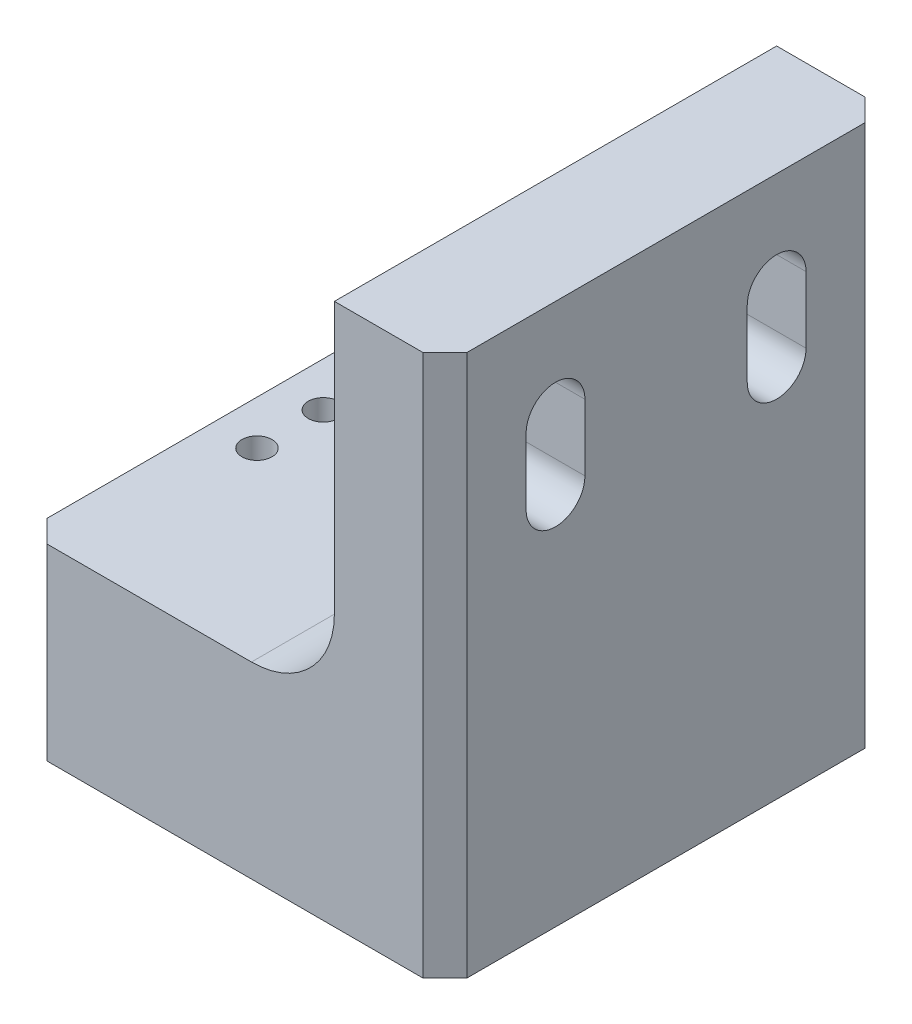
ISO-10303-21;
HEADER;
FILE_DESCRIPTION(('STEP AP214'),'2;1');
FILE_NAME('part.step','',(''),(''),'','','');
FILE_SCHEMA(('AUTOMOTIVE_DESIGN { 1 0 10303 214 1 1 1 1 }'));
ENDSEC;
DATA;
#1=APPLICATION_CONTEXT('core data for automotive mechanical design processes');
#2=APPLICATION_PROTOCOL_DEFINITION('international standard','automotive_design',2000,#1);
#3=PRODUCT_CONTEXT('',#1,'mechanical');
#4=PRODUCT('Part','Part','',(#3));
#5=PRODUCT_RELATED_PRODUCT_CATEGORY('part','',(#4));
#6=PRODUCT_DEFINITION_FORMATION('','',#4);
#7=PRODUCT_DEFINITION_CONTEXT('part definition',#1,'design');
#8=PRODUCT_DEFINITION('design','',#6,#7);
#9=PRODUCT_DEFINITION_SHAPE('','',#8);
#10=(LENGTH_UNIT() NAMED_UNIT(*) SI_UNIT(.MILLI.,.METRE.));
#11=(NAMED_UNIT(*) PLANE_ANGLE_UNIT() SI_UNIT($,.RADIAN.));
#12=(NAMED_UNIT(*) SI_UNIT($,.STERADIAN.) SOLID_ANGLE_UNIT());
#13=UNCERTAINTY_MEASURE_WITH_UNIT(LENGTH_MEASURE(1.E-05),#10,'distance_accuracy_value','');
#14=(GEOMETRIC_REPRESENTATION_CONTEXT(3) GLOBAL_UNCERTAINTY_ASSIGNED_CONTEXT((#13)) GLOBAL_UNIT_ASSIGNED_CONTEXT((#10,
#11,#12)) REPRESENTATION_CONTEXT('',''));
#15=CARTESIAN_POINT('',(0.,0.,0.));
#16=DIRECTION('',(0.,0.,1.));
#17=DIRECTION('',(1.,0.,0.));
#18=AXIS2_PLACEMENT_3D('',#15,#16,#17);
#19=CARTESIAN_POINT('',(0.,21.59,-25.4));
#20=DIRECTION('',(-1.,0.,0.));
#21=DIRECTION('',(0.,0.,1.));
#22=AXIS2_PLACEMENT_3D('',#19,#20,#21);
#23=PLANE('',#22);
#24=DIRECTION('',(0.,0.,1.));
#25=VECTOR('',#24,1.);
#26=CARTESIAN_POINT('',(0.,21.59,-25.4));
#27=LINE('',#26,#25);
#28=CARTESIAN_POINT('',(0.,21.59,-22.86));
#29=VERTEX_POINT('',#28);
#30=CARTESIAN_POINT('',(0.,21.59,22.86));
#31=VERTEX_POINT('',#30);
#32=EDGE_CURVE('E268',#29,#31,#27,.T.);
#33=ORIENTED_EDGE('',*,*,#32,.F.);
#34=DIRECTION('',(0.,-1.,0.));
#35=VECTOR('',#34,1.);
#36=CARTESIAN_POINT('',(0.,0.,-22.86));
#37=LINE('',#36,#35);
#38=CARTESIAN_POINT('',(0.,0.,-22.86));
#39=VERTEX_POINT('',#38);
#40=EDGE_CURVE('E292',#29,#39,#37,.T.);
#41=ORIENTED_EDGE('',*,*,#40,.T.);
#42=DIRECTION('',(0.,0.,1.));
#43=VECTOR('',#42,1.);
#44=CARTESIAN_POINT('',(0.,0.,-25.4));
#45=LINE('',#44,#43);
#46=CARTESIAN_POINT('',(0.,0.,22.86));
#47=VERTEX_POINT('',#46);
#48=EDGE_CURVE('E267',#39,#47,#45,.T.);
#49=ORIENTED_EDGE('',*,*,#48,.T.);
#50=DIRECTION('',(0.,1.,0.));
#51=VECTOR('',#50,1.);
#52=CARTESIAN_POINT('',(0.,21.59,22.86));
#53=LINE('',#52,#51);
#54=EDGE_CURVE('E290',#47,#31,#53,.T.);
#55=ORIENTED_EDGE('',*,*,#54,.T.);
#56=EDGE_LOOP('',(#33,#41,#49,#55));
#57=FACE_BOUND('',#56,.T.);
#58=ADVANCED_FACE('F32',(#57),#23,.T.);
#59=CARTESIAN_POINT('',(35.56,21.59,-25.4));
#60=DIRECTION('',(0.,1.,0.));
#61=DIRECTION('',(-1.,0.,0.));
#62=AXIS2_PLACEMENT_3D('',#59,#60,#61);
#63=PLANE('',#62);
#64=CARTESIAN_POINT('',(5.08,21.59,-3.81));
#65=DIRECTION('',(0.,1.,0.));
#66=DIRECTION('',(0.,0.,1.));
#67=AXIS2_PLACEMENT_3D('',#64,#65,#66);
#68=CIRCLE('',#67,1.7272);
#69=CARTESIAN_POINT('',(5.08,21.59,-2.0828));
#70=VERTEX_POINT('',#69);
#71=EDGE_CURVE('E233',#70,#70,#68,.T.);
#72=ORIENTED_EDGE('',*,*,#71,.F.);
#73=EDGE_LOOP('',(#72));
#74=FACE_BOUND('',#73,.T.);
#75=CARTESIAN_POINT('',(5.08,21.59,3.81));
#76=DIRECTION('',(0.,1.,0.));
#77=DIRECTION('',(0.,0.,1.));
#78=AXIS2_PLACEMENT_3D('',#75,#76,#77);
#79=CIRCLE('',#78,1.7272);
#80=CARTESIAN_POINT('',(5.08,21.59,5.5372));
#81=VERTEX_POINT('',#80);
#82=EDGE_CURVE('E239',#81,#81,#79,.T.);
#83=ORIENTED_EDGE('',*,*,#82,.F.);
#84=EDGE_LOOP('',(#83));
#85=FACE_BOUND('',#84,.T.);
#86=DIRECTION('',(-1.,0.,0.));
#87=VECTOR('',#86,1.);
#88=CARTESIAN_POINT('',(35.56,21.59,-25.4));
#89=LINE('',#88,#87);
#90=CARTESIAN_POINT('',(26.035,21.59,-25.4));
#91=VERTEX_POINT('',#90);
#92=CARTESIAN_POINT('',(2.54,21.59,-25.4));
#93=VERTEX_POINT('',#92);
#94=EDGE_CURVE('E264',#91,#93,#89,.T.);
#95=ORIENTED_EDGE('',*,*,#94,.T.);
#96=DIRECTION('',(-0.707106781186548,0.,0.707106781186548));
#97=VECTOR('',#96,1.);
#98=CARTESIAN_POINT('',(19.05,21.59,-41.91));
#99=LINE('',#98,#97);
#100=EDGE_CURVE('E309',#93,#29,#99,.T.);
#101=ORIENTED_EDGE('',*,*,#100,.T.);
#102=ORIENTED_EDGE('',*,*,#32,.T.);
#103=DIRECTION('',(-0.707106781186548,0.,-0.707106781186548));
#104=VECTOR('',#103,1.);
#105=CARTESIAN_POINT('',(-6.34999999999999,21.59,16.51));
#106=LINE('',#105,#104);
#107=CARTESIAN_POINT('',(2.54000000000002,21.59,25.4));
#108=VERTEX_POINT('',#107);
#109=EDGE_CURVE('E307',#31,#108,#106,.F.);
#110=ORIENTED_EDGE('',*,*,#109,.T.);
#111=DIRECTION('',(-1.,0.,0.));
#112=VECTOR('',#111,1.);
#113=CARTESIAN_POINT('',(35.56,21.59,25.4));
#114=LINE('',#113,#112);
#115=CARTESIAN_POINT('',(26.035,21.59,25.4));
#116=VERTEX_POINT('',#115);
#117=EDGE_CURVE('E253',#116,#108,#114,.T.);
#118=ORIENTED_EDGE('',*,*,#117,.F.);
#119=DIRECTION('',(0.,0.,1.));
#120=VECTOR('',#119,1.);
#121=CARTESIAN_POINT('',(26.035,21.59,-25.4));
#122=LINE('',#121,#120);
#123=EDGE_CURVE('E284',#116,#91,#122,.F.);
#124=ORIENTED_EDGE('',*,*,#123,.T.);
#125=EDGE_LOOP('',(#95,#101,#102,#110,#118,#124));
#126=FACE_BOUND('',#125,.T.);
#127=ADVANCED_FACE('F344',(#74,#85,#126),#63,.T.);
#128=CARTESIAN_POINT('',(35.56,62.23,-25.4));
#129=DIRECTION('',(-1.,0.,0.));
#130=DIRECTION('',(0.,0.,1.));
#131=AXIS2_PLACEMENT_3D('',#128,#129,#130);
#132=PLANE('',#131);
#133=CARTESIAN_POINT('',(35.56,50.8,12.7));
#134=DIRECTION('',(-1.,0.,0.));
#135=DIRECTION('',(0.,0.,1.));
#136=AXIS2_PLACEMENT_3D('',#133,#134,#135);
#137=CIRCLE('',#136,3.3782);
#138=CARTESIAN_POINT('',(35.56,50.8,16.0782));
#139=VERTEX_POINT('',#138);
#140=CARTESIAN_POINT('',(35.56,50.8,9.3218));
#141=VERTEX_POINT('',#140);
#142=EDGE_CURVE('E202',#139,#141,#137,.T.);
#143=ORIENTED_EDGE('',*,*,#142,.F.);
#144=DIRECTION('',(0.,1.,0.));
#145=VECTOR('',#144,1.);
#146=CARTESIAN_POINT('',(35.56,62.23,16.0782));
#147=LINE('',#146,#145);
#148=CARTESIAN_POINT('',(35.56,43.18,16.0782));
#149=VERTEX_POINT('',#148);
#150=EDGE_CURVE('E195',#149,#139,#147,.T.);
#151=ORIENTED_EDGE('',*,*,#150,.F.);
#152=CARTESIAN_POINT('',(35.56,43.18,12.7));
#153=DIRECTION('',(-1.,0.,0.));
#154=DIRECTION('',(0.,0.,1.));
#155=AXIS2_PLACEMENT_3D('',#152,#153,#154);
#156=CIRCLE('',#155,3.3782);
#157=CARTESIAN_POINT('',(35.56,43.18,9.3218));
#158=VERTEX_POINT('',#157);
#159=EDGE_CURVE('E170',#158,#149,#156,.T.);
#160=ORIENTED_EDGE('',*,*,#159,.F.);
#161=DIRECTION('',(0.,-1.,0.));
#162=VECTOR('',#161,1.);
#163=CARTESIAN_POINT('',(35.56,62.23,9.3218));
#164=LINE('',#163,#162);
#165=EDGE_CURVE('E200',#141,#158,#164,.T.);
#166=ORIENTED_EDGE('',*,*,#165,.F.);
#167=EDGE_LOOP('',(#143,#151,#160,#166));
#168=FACE_BOUND('',#167,.T.);
#169=CARTESIAN_POINT('',(35.56,50.8,-12.7));
#170=DIRECTION('',(-1.,0.,0.));
#171=DIRECTION('',(0.,0.,1.));
#172=AXIS2_PLACEMENT_3D('',#169,#170,#171);
#173=CIRCLE('',#172,3.3782);
#174=CARTESIAN_POINT('',(35.56,50.8,-9.32179999999999));
#175=VERTEX_POINT('',#174);
#176=CARTESIAN_POINT('',(35.56,50.8,-16.0782));
#177=VERTEX_POINT('',#176);
#178=EDGE_CURVE('E231',#175,#177,#173,.T.);
#179=ORIENTED_EDGE('',*,*,#178,.F.);
#180=DIRECTION('',(0.,1.,0.));
#181=VECTOR('',#180,1.);
#182=CARTESIAN_POINT('',(35.56,62.23,-9.32179999999999));
#183=LINE('',#182,#181);
#184=CARTESIAN_POINT('',(35.56,43.18,-9.32179999999999));
#185=VERTEX_POINT('',#184);
#186=EDGE_CURVE('E218',#185,#175,#183,.T.);
#187=ORIENTED_EDGE('',*,*,#186,.F.);
#188=CARTESIAN_POINT('',(35.56,43.18,-12.7));
#189=DIRECTION('',(-1.,0.,0.));
#190=DIRECTION('',(0.,0.,1.));
#191=AXIS2_PLACEMENT_3D('',#188,#189,#190);
#192=CIRCLE('',#191,3.3782);
#193=CARTESIAN_POINT('',(35.56,43.18,-16.0782));
#194=VERTEX_POINT('',#193);
#195=EDGE_CURVE('E226',#194,#185,#192,.T.);
#196=ORIENTED_EDGE('',*,*,#195,.F.);
#197=DIRECTION('',(0.,-1.,0.));
#198=VECTOR('',#197,1.);
#199=CARTESIAN_POINT('',(35.56,62.23,-16.0782));
#200=LINE('',#199,#198);
#201=EDGE_CURVE('E229',#177,#194,#200,.T.);
#202=ORIENTED_EDGE('',*,*,#201,.F.);
#203=EDGE_LOOP('',(#179,#187,#196,#202));
#204=FACE_BOUND('',#203,.T.);
#205=DIRECTION('',(0.,-1.,0.));
#206=VECTOR('',#205,1.);
#207=CARTESIAN_POINT('',(35.56,62.23,-25.4));
#208=LINE('',#207,#206);
#209=CARTESIAN_POINT('',(35.56,62.23,-25.4));
#210=VERTEX_POINT('',#209);
#211=CARTESIAN_POINT('',(35.56,31.115,-25.4));
#212=VERTEX_POINT('',#211);
#213=EDGE_CURVE('E261',#210,#212,#208,.T.);
#214=ORIENTED_EDGE('',*,*,#213,.T.);
#215=DIRECTION('',(0.,0.,1.));
#216=VECTOR('',#215,1.);
#217=CARTESIAN_POINT('',(35.56,31.115,25.4));
#218=LINE('',#217,#216);
#219=CARTESIAN_POINT('',(35.56,31.115,25.4));
#220=VERTEX_POINT('',#219);
#221=EDGE_CURVE('E271',#212,#220,#218,.T.);
#222=ORIENTED_EDGE('',*,*,#221,.T.);
#223=DIRECTION('',(0.,-1.,0.));
#224=VECTOR('',#223,1.);
#225=CARTESIAN_POINT('',(35.56,62.23,25.4));
#226=LINE('',#225,#224);
#227=CARTESIAN_POINT('',(35.56,62.23,25.4));
#228=VERTEX_POINT('',#227);
#229=EDGE_CURVE('E250',#228,#220,#226,.T.);
#230=ORIENTED_EDGE('',*,*,#229,.F.);
#231=DIRECTION('',(0.,0.,1.));
#232=VECTOR('',#231,1.);
#233=CARTESIAN_POINT('',(35.56,62.23,-25.4));
#234=LINE('',#233,#232);
#235=EDGE_CURVE('E272',#210,#228,#234,.T.);
#236=ORIENTED_EDGE('',*,*,#235,.F.);
#237=EDGE_LOOP('',(#214,#222,#230,#236));
#238=FACE_BOUND('',#237,.T.);
#239=ADVANCED_FACE('F362',(#168,#204,#238),#132,.T.);
#240=CARTESIAN_POINT('',(48.26,62.23,-25.4));
#241=DIRECTION('',(0.,1.,0.));
#242=DIRECTION('',(0.,0.,1.));
#243=AXIS2_PLACEMENT_3D('',#240,#241,#242);
#244=PLANE('',#243);
#245=DIRECTION('',(0.,0.,1.));
#246=VECTOR('',#245,1.);
#247=CARTESIAN_POINT('',(48.26,62.23,-25.4));
#248=LINE('',#247,#246);
#249=CARTESIAN_POINT('',(48.26,62.23,-22.86));
#250=VERTEX_POINT('',#249);
#251=CARTESIAN_POINT('',(48.26,62.23,22.86));
#252=VERTEX_POINT('',#251);
#253=EDGE_CURVE('E275',#250,#252,#248,.T.);
#254=ORIENTED_EDGE('',*,*,#253,.F.);
#255=DIRECTION('',(-0.707106781186548,0.,-0.707106781186548));
#256=VECTOR('',#255,1.);
#257=CARTESIAN_POINT('',(46.99,62.23,-24.13));
#258=LINE('',#257,#256);
#259=CARTESIAN_POINT('',(45.72,62.23,-25.4));
#260=VERTEX_POINT('',#259);
#261=EDGE_CURVE('E11',#250,#260,#258,.T.);
#262=ORIENTED_EDGE('',*,*,#261,.T.);
#263=DIRECTION('',(-1.,0.,0.));
#264=VECTOR('',#263,1.);
#265=CARTESIAN_POINT('',(48.26,62.23,-25.4));
#266=LINE('',#265,#264);
#267=EDGE_CURVE('E259',#260,#210,#266,.T.);
#268=ORIENTED_EDGE('',*,*,#267,.T.);
#269=ORIENTED_EDGE('',*,*,#235,.T.);
#270=DIRECTION('',(-1.,0.,0.));
#271=VECTOR('',#270,1.);
#272=CARTESIAN_POINT('',(48.26,62.23,25.4));
#273=LINE('',#272,#271);
#274=CARTESIAN_POINT('',(45.72,62.23,25.4));
#275=VERTEX_POINT('',#274);
#276=EDGE_CURVE('E248',#275,#228,#273,.T.);
#277=ORIENTED_EDGE('',*,*,#276,.F.);
#278=DIRECTION('',(-0.707106781186548,0.,0.707106781186548));
#279=VECTOR('',#278,1.);
#280=CARTESIAN_POINT('',(72.39,62.23,-1.27));
#281=LINE('',#280,#279);
#282=EDGE_CURVE('E40',#275,#252,#281,.F.);
#283=ORIENTED_EDGE('',*,*,#282,.T.);
#284=EDGE_LOOP('',(#254,#262,#268,#269,#277,#283));
#285=FACE_BOUND('',#284,.T.);
#286=ADVANCED_FACE('F324',(#285),#244,.T.);
#287=CARTESIAN_POINT('',(48.26,0.,-25.4));
#288=DIRECTION('',(1.,0.,0.));
#289=DIRECTION('',(0.,0.,-1.));
#290=AXIS2_PLACEMENT_3D('',#287,#288,#289);
#291=PLANE('',#290);
#292=CARTESIAN_POINT('',(48.26,50.8,12.7));
#293=DIRECTION('',(1.,0.,0.));
#294=DIRECTION('',(0.,0.,-1.));
#295=AXIS2_PLACEMENT_3D('',#292,#293,#294);
#296=CIRCLE('',#295,3.3782);
#297=CARTESIAN_POINT('',(48.26,50.8,9.3218));
#298=VERTEX_POINT('',#297);
#299=CARTESIAN_POINT('',(48.26,50.8,16.0782));
#300=VERTEX_POINT('',#299);
#301=EDGE_CURVE('E183',#298,#300,#296,.T.);
#302=ORIENTED_EDGE('',*,*,#301,.F.);
#303=DIRECTION('',(0.,1.,0.));
#304=VECTOR('',#303,1.);
#305=CARTESIAN_POINT('',(48.26,50.8,9.3218));
#306=LINE('',#305,#304);
#307=CARTESIAN_POINT('',(48.26,43.18,9.3218));
#308=VERTEX_POINT('',#307);
#309=EDGE_CURVE('E188',#308,#298,#306,.T.);
#310=ORIENTED_EDGE('',*,*,#309,.F.);
#311=CARTESIAN_POINT('',(48.26,43.18,12.7));
#312=DIRECTION('',(1.,0.,0.));
#313=DIRECTION('',(0.,0.,-1.));
#314=AXIS2_PLACEMENT_3D('',#311,#312,#313);
#315=CIRCLE('',#314,3.3782);
#316=CARTESIAN_POINT('',(48.26,43.18,16.0782));
#317=VERTEX_POINT('',#316);
#318=EDGE_CURVE('E167',#317,#308,#315,.T.);
#319=ORIENTED_EDGE('',*,*,#318,.F.);
#320=DIRECTION('',(0.,-1.,0.));
#321=VECTOR('',#320,1.);
#322=CARTESIAN_POINT('',(48.26,50.8,16.0782));
#323=LINE('',#322,#321);
#324=EDGE_CURVE('E178',#300,#317,#323,.T.);
#325=ORIENTED_EDGE('',*,*,#324,.F.);
#326=EDGE_LOOP('',(#302,#310,#319,#325));
#327=FACE_BOUND('',#326,.T.);
#328=CARTESIAN_POINT('',(48.26,50.8,-12.7));
#329=DIRECTION('',(1.,0.,0.));
#330=DIRECTION('',(0.,0.,-1.));
#331=AXIS2_PLACEMENT_3D('',#328,#329,#330);
#332=CIRCLE('',#331,3.3782);
#333=CARTESIAN_POINT('',(48.26,50.8,-16.0782));
#334=VERTEX_POINT('',#333);
#335=CARTESIAN_POINT('',(48.26,50.8,-9.32179999999999));
#336=VERTEX_POINT('',#335);
#337=EDGE_CURVE('E204',#334,#336,#332,.T.);
#338=ORIENTED_EDGE('',*,*,#337,.F.);
#339=DIRECTION('',(0.,1.,0.));
#340=VECTOR('',#339,1.);
#341=CARTESIAN_POINT('',(48.26,50.8,-16.0782));
#342=LINE('',#341,#340);
#343=CARTESIAN_POINT('',(48.26,43.18,-16.0782));
#344=VERTEX_POINT('',#343);
#345=EDGE_CURVE('E212',#344,#334,#342,.T.);
#346=ORIENTED_EDGE('',*,*,#345,.F.);
#347=CARTESIAN_POINT('',(48.26,43.18,-12.7));
#348=DIRECTION('',(1.,0.,0.));
#349=DIRECTION('',(0.,0.,-1.));
#350=AXIS2_PLACEMENT_3D('',#347,#348,#349);
#351=CIRCLE('',#350,3.3782);
#352=CARTESIAN_POINT('',(48.26,43.18,-9.32179999999999));
#353=VERTEX_POINT('',#352);
#354=EDGE_CURVE('E209',#353,#344,#351,.T.);
#355=ORIENTED_EDGE('',*,*,#354,.F.);
#356=DIRECTION('',(0.,-1.,0.));
#357=VECTOR('',#356,1.);
#358=CARTESIAN_POINT('',(48.26,50.8,-9.32179999999999));
#359=LINE('',#358,#357);
#360=EDGE_CURVE('E206',#336,#353,#359,.T.);
#361=ORIENTED_EDGE('',*,*,#360,.F.);
#362=EDGE_LOOP('',(#338,#346,#355,#361));
#363=FACE_BOUND('',#362,.T.);
#364=DIRECTION('',(0.,0.,1.));
#365=VECTOR('',#364,1.);
#366=CARTESIAN_POINT('',(48.26,0.,-25.4));
#367=LINE('',#366,#365);
#368=CARTESIAN_POINT('',(48.26,0.,-22.86));
#369=VERTEX_POINT('',#368);
#370=CARTESIAN_POINT('',(48.26,0.,22.86));
#371=VERTEX_POINT('',#370);
#372=EDGE_CURVE('E277',#369,#371,#367,.T.);
#373=ORIENTED_EDGE('',*,*,#372,.F.);
#374=DIRECTION('',(0.,1.,0.));
#375=VECTOR('',#374,1.);
#376=CARTESIAN_POINT('',(48.26,62.23,-22.86));
#377=LINE('',#376,#375);
#378=EDGE_CURVE('E319',#369,#250,#377,.T.);
#379=ORIENTED_EDGE('',*,*,#378,.T.);
#380=ORIENTED_EDGE('',*,*,#253,.T.);
#381=DIRECTION('',(0.,-1.,0.));
#382=VECTOR('',#381,1.);
#383=CARTESIAN_POINT('',(48.26,0.,22.86));
#384=LINE('',#383,#382);
#385=EDGE_CURVE('E317',#252,#371,#384,.T.);
#386=ORIENTED_EDGE('',*,*,#385,.T.);
#387=EDGE_LOOP('',(#373,#379,#380,#386));
#388=FACE_BOUND('',#387,.T.);
#389=ADVANCED_FACE('F185',(#327,#363,#388),#291,.T.);
#390=CARTESIAN_POINT('',(0.,0.,-25.4));
#391=DIRECTION('',(0.,-1.,0.));
#392=DIRECTION('',(0.,0.,-1.));
#393=AXIS2_PLACEMENT_3D('',#390,#391,#392);
#394=PLANE('',#393);
#395=CARTESIAN_POINT('',(5.08,0.,-3.81));
#396=DIRECTION('',(0.,1.,0.));
#397=DIRECTION('',(0.,0.,1.));
#398=AXIS2_PLACEMENT_3D('',#395,#396,#397);
#399=CIRCLE('',#398,1.72719999999999);
#400=CARTESIAN_POINT('',(5.08,0.,-2.08280000000001));
#401=VERTEX_POINT('',#400);
#402=EDGE_CURVE('E236',#401,#401,#399,.T.);
#403=ORIENTED_EDGE('',*,*,#402,.T.);
#404=EDGE_LOOP('',(#403));
#405=FACE_BOUND('',#404,.T.);
#406=CARTESIAN_POINT('',(5.08,0.,3.81));
#407=DIRECTION('',(0.,1.,0.));
#408=DIRECTION('',(0.,0.,1.));
#409=AXIS2_PLACEMENT_3D('',#406,#407,#408);
#410=CIRCLE('',#409,1.72719999999999);
#411=CARTESIAN_POINT('',(5.08,0.,5.53719999999999));
#412=VERTEX_POINT('',#411);
#413=EDGE_CURVE('E242',#412,#412,#410,.T.);
#414=ORIENTED_EDGE('',*,*,#413,.T.);
#415=EDGE_LOOP('',(#414));
#416=FACE_BOUND('',#415,.T.);
#417=ORIENTED_EDGE('',*,*,#48,.F.);
#418=DIRECTION('',(0.707106781186548,0.,-0.707106781186548));
#419=VECTOR('',#418,1.);
#420=CARTESIAN_POINT('',(1.27,0.,-24.13));
#421=LINE('',#420,#419);
#422=CARTESIAN_POINT('',(2.54,0.,-25.4));
#423=VERTEX_POINT('',#422);
#424=EDGE_CURVE('E301',#39,#423,#421,.T.);
#425=ORIENTED_EDGE('',*,*,#424,.T.);
#426=DIRECTION('',(1.,0.,0.));
#427=VECTOR('',#426,1.);
#428=CARTESIAN_POINT('',(0.,0.,-25.4));
#429=LINE('',#428,#427);
#430=CARTESIAN_POINT('',(45.72,0.,-25.4));
#431=VERTEX_POINT('',#430);
#432=EDGE_CURVE('E256',#423,#431,#429,.T.);
#433=ORIENTED_EDGE('',*,*,#432,.T.);
#434=DIRECTION('',(0.707106781186548,0.,0.707106781186548));
#435=VECTOR('',#434,1.);
#436=CARTESIAN_POINT('',(22.86,0.,-48.26));
#437=LINE('',#436,#435);
#438=EDGE_CURVE('E297',#431,#369,#437,.T.);
#439=ORIENTED_EDGE('',*,*,#438,.T.);
#440=ORIENTED_EDGE('',*,*,#372,.T.);
#441=DIRECTION('',(0.707106781186548,0.,-0.707106781186548));
#442=VECTOR('',#441,1.);
#443=CARTESIAN_POINT('',(48.26,0.,22.86));
#444=LINE('',#443,#442);
#445=CARTESIAN_POINT('',(45.72,0.,25.4));
#446=VERTEX_POINT('',#445);
#447=EDGE_CURVE('E295',#371,#446,#444,.F.);
#448=ORIENTED_EDGE('',*,*,#447,.T.);
#449=DIRECTION('',(1.,0.,0.));
#450=VECTOR('',#449,1.);
#451=CARTESIAN_POINT('',(0.,0.,25.4));
#452=LINE('',#451,#450);
#453=CARTESIAN_POINT('',(2.54000000000003,0.,25.4));
#454=VERTEX_POINT('',#453);
#455=EDGE_CURVE('E245',#454,#446,#452,.T.);
#456=ORIENTED_EDGE('',*,*,#455,.F.);
#457=DIRECTION('',(0.707106781186548,0.,0.707106781186548));
#458=VECTOR('',#457,1.);
#459=CARTESIAN_POINT('',(-24.13,0.,-1.27000000000001));
#460=LINE('',#459,#458);
#461=EDGE_CURVE('E299',#454,#47,#460,.F.);
#462=ORIENTED_EDGE('',*,*,#461,.T.);
#463=EDGE_LOOP('',(#417,#425,#433,#439,#440,#448,#456,#462));
#464=FACE_BOUND('',#463,.T.);
#465=ADVANCED_FACE('F334',(#405,#416,#464),#394,.T.);
#466=CARTESIAN_POINT('',(0.,0.,-25.4));
#467=DIRECTION('',(0.,0.,1.));
#468=DIRECTION('',(1.,0.,0.));
#469=AXIS2_PLACEMENT_3D('',#466,#467,#468);
#470=PLANE('',#469);
#471=ORIENTED_EDGE('',*,*,#432,.F.);
#472=DIRECTION('',(0.,1.,0.));
#473=VECTOR('',#472,1.);
#474=CARTESIAN_POINT('',(2.54,21.59,-25.4));
#475=LINE('',#474,#473);
#476=EDGE_CURVE('E305',#423,#93,#475,.T.);
#477=ORIENTED_EDGE('',*,*,#476,.T.);
#478=ORIENTED_EDGE('',*,*,#94,.F.);
#479=CARTESIAN_POINT('',(26.035,31.115,-25.4));
#480=DIRECTION('',(0.,0.,1.));
#481=DIRECTION('',(1.,0.,0.));
#482=AXIS2_PLACEMENT_3D('',#479,#480,#481);
#483=CIRCLE('',#482,9.525);
#484=EDGE_CURVE('E288',#91,#212,#483,.T.);
#485=ORIENTED_EDGE('',*,*,#484,.T.);
#486=ORIENTED_EDGE('',*,*,#213,.F.);
#487=ORIENTED_EDGE('',*,*,#267,.F.);
#488=DIRECTION('',(0.,-1.,0.));
#489=VECTOR('',#488,1.);
#490=CARTESIAN_POINT('',(45.72,0.,-25.4));
#491=LINE('',#490,#489);
#492=EDGE_CURVE('E303',#260,#431,#491,.T.);
#493=ORIENTED_EDGE('',*,*,#492,.T.);
#494=EDGE_LOOP('',(#471,#477,#478,#485,#486,#487,#493));
#495=FACE_BOUND('',#494,.T.);
#496=ADVANCED_FACE('F330',(#495),#470,.F.);
#497=CARTESIAN_POINT('',(0.,0.,25.4));
#498=DIRECTION('',(0.,0.,1.));
#499=DIRECTION('',(1.,0.,0.));
#500=AXIS2_PLACEMENT_3D('',#497,#498,#499);
#501=PLANE('',#500);
#502=ORIENTED_EDGE('',*,*,#117,.T.);
#503=DIRECTION('',(0.,-1.,0.));
#504=VECTOR('',#503,1.);
#505=CARTESIAN_POINT('',(2.54000000000001,0.,25.4));
#506=LINE('',#505,#504);
#507=EDGE_CURVE('E314',#108,#454,#506,.T.);
#508=ORIENTED_EDGE('',*,*,#507,.T.);
#509=ORIENTED_EDGE('',*,*,#455,.T.);
#510=DIRECTION('',(0.,1.,0.));
#511=VECTOR('',#510,1.);
#512=CARTESIAN_POINT('',(45.72,0.,25.4));
#513=LINE('',#512,#511);
#514=EDGE_CURVE('E311',#446,#275,#513,.T.);
#515=ORIENTED_EDGE('',*,*,#514,.T.);
#516=ORIENTED_EDGE('',*,*,#276,.T.);
#517=ORIENTED_EDGE('',*,*,#229,.T.);
#518=CARTESIAN_POINT('',(26.035,31.115,25.4));
#519=DIRECTION('',(0.,0.,1.));
#520=DIRECTION('',(1.,0.,0.));
#521=AXIS2_PLACEMENT_3D('',#518,#519,#520);
#522=CIRCLE('',#521,9.525);
#523=EDGE_CURVE('E286',#220,#116,#522,.F.);
#524=ORIENTED_EDGE('',*,*,#523,.T.);
#525=EDGE_LOOP('',(#502,#508,#509,#515,#516,#517,#524));
#526=FACE_BOUND('',#525,.T.);
#527=ADVANCED_FACE('F354',(#526),#501,.T.);
#528=CARTESIAN_POINT('',(5.08,21.59,3.81));
#529=DIRECTION('',(0.,1.,0.));
#530=DIRECTION('',(0.,0.,1.));
#531=AXIS2_PLACEMENT_3D('',#528,#529,#530);
#532=CYLINDRICAL_SURFACE('',#531,1.7272);
#533=ORIENTED_EDGE('',*,*,#413,.F.);
#534=EDGE_LOOP('',(#533));
#535=FACE_BOUND('',#534,.T.);
#536=ORIENTED_EDGE('',*,*,#82,.T.);
#537=EDGE_LOOP('',(#536));
#538=FACE_BOUND('',#537,.T.);
#539=ADVANCED_FACE('F488',(#535,#538),#532,.F.);
#540=CARTESIAN_POINT('',(5.08,21.59,-3.81));
#541=DIRECTION('',(0.,1.,0.));
#542=DIRECTION('',(0.,0.,1.));
#543=AXIS2_PLACEMENT_3D('',#540,#541,#542);
#544=CYLINDRICAL_SURFACE('',#543,1.7272);
#545=ORIENTED_EDGE('',*,*,#402,.F.);
#546=EDGE_LOOP('',(#545));
#547=FACE_BOUND('',#546,.T.);
#548=ORIENTED_EDGE('',*,*,#71,.T.);
#549=EDGE_LOOP('',(#548));
#550=FACE_BOUND('',#549,.T.);
#551=ADVANCED_FACE('F479',(#547,#550),#544,.F.);
#552=CARTESIAN_POINT('',(0.,50.8,-12.7));
#553=DIRECTION('',(1.,0.,0.));
#554=DIRECTION('',(0.,0.,-1.));
#555=AXIS2_PLACEMENT_3D('',#552,#553,#554);
#556=CYLINDRICAL_SURFACE('',#555,3.3782);
#557=ORIENTED_EDGE('',*,*,#178,.T.);
#558=DIRECTION('',(1.,0.,0.));
#559=VECTOR('',#558,1.);
#560=CARTESIAN_POINT('',(0.,50.8,-16.0782));
#561=LINE('',#560,#559);
#562=EDGE_CURVE('E216',#177,#334,#561,.T.);
#563=ORIENTED_EDGE('',*,*,#562,.T.);
#564=ORIENTED_EDGE('',*,*,#337,.T.);
#565=DIRECTION('',(1.,0.,0.));
#566=VECTOR('',#565,1.);
#567=CARTESIAN_POINT('',(0.,50.8,-9.32179999999999));
#568=LINE('',#567,#566);
#569=EDGE_CURVE('E215',#175,#336,#568,.T.);
#570=ORIENTED_EDGE('',*,*,#569,.F.);
#571=EDGE_LOOP('',(#557,#563,#564,#570));
#572=FACE_BOUND('',#571,.T.);
#573=ADVANCED_FACE('F470',(#572),#556,.F.);
#574=CARTESIAN_POINT('',(0.,50.8,-16.0782));
#575=DIRECTION('',(0.,0.,-1.));
#576=DIRECTION('',(-1.,0.,0.));
#577=AXIS2_PLACEMENT_3D('',#574,#575,#576);
#578=PLANE('',#577);
#579=ORIENTED_EDGE('',*,*,#201,.T.);
#580=DIRECTION('',(1.,0.,0.));
#581=VECTOR('',#580,1.);
#582=CARTESIAN_POINT('',(0.,43.18,-16.0782));
#583=LINE('',#582,#581);
#584=EDGE_CURVE('E219',#194,#344,#583,.T.);
#585=ORIENTED_EDGE('',*,*,#584,.T.);
#586=ORIENTED_EDGE('',*,*,#345,.T.);
#587=ORIENTED_EDGE('',*,*,#562,.F.);
#588=EDGE_LOOP('',(#579,#585,#586,#587));
#589=FACE_BOUND('',#588,.T.);
#590=ADVANCED_FACE('F461',(#589),#578,.F.);
#591=CARTESIAN_POINT('',(0.,43.18,-12.7));
#592=DIRECTION('',(1.,0.,0.));
#593=DIRECTION('',(0.,0.,-1.));
#594=AXIS2_PLACEMENT_3D('',#591,#592,#593);
#595=CYLINDRICAL_SURFACE('',#594,3.3782);
#596=ORIENTED_EDGE('',*,*,#195,.T.);
#597=DIRECTION('',(1.,0.,0.));
#598=VECTOR('',#597,1.);
#599=CARTESIAN_POINT('',(0.,43.18,-9.32179999999999));
#600=LINE('',#599,#598);
#601=EDGE_CURVE('E221',#185,#353,#600,.T.);
#602=ORIENTED_EDGE('',*,*,#601,.T.);
#603=ORIENTED_EDGE('',*,*,#354,.T.);
#604=ORIENTED_EDGE('',*,*,#584,.F.);
#605=EDGE_LOOP('',(#596,#602,#603,#604));
#606=FACE_BOUND('',#605,.T.);
#607=ADVANCED_FACE('F452',(#606),#595,.F.);
#608=CARTESIAN_POINT('',(0.,50.8,-9.32179999999999));
#609=DIRECTION('',(0.,0.,1.));
#610=DIRECTION('',(0.,-1.,0.));
#611=AXIS2_PLACEMENT_3D('',#608,#609,#610);
#612=PLANE('',#611);
#613=ORIENTED_EDGE('',*,*,#186,.T.);
#614=ORIENTED_EDGE('',*,*,#569,.T.);
#615=ORIENTED_EDGE('',*,*,#360,.T.);
#616=ORIENTED_EDGE('',*,*,#601,.F.);
#617=EDGE_LOOP('',(#613,#614,#615,#616));
#618=FACE_BOUND('',#617,.T.);
#619=ADVANCED_FACE('F443',(#618),#612,.F.);
#620=CARTESIAN_POINT('',(0.,50.8,12.7));
#621=DIRECTION('',(1.,0.,0.));
#622=DIRECTION('',(0.,0.,-1.));
#623=AXIS2_PLACEMENT_3D('',#620,#621,#622);
#624=CYLINDRICAL_SURFACE('',#623,3.3782);
#625=ORIENTED_EDGE('',*,*,#142,.T.);
#626=DIRECTION('',(1.,0.,0.));
#627=VECTOR('',#626,1.);
#628=CARTESIAN_POINT('',(0.,50.8,9.3218));
#629=LINE('',#628,#627);
#630=EDGE_CURVE('E193',#141,#298,#629,.T.);
#631=ORIENTED_EDGE('',*,*,#630,.T.);
#632=ORIENTED_EDGE('',*,*,#301,.T.);
#633=DIRECTION('',(1.,0.,0.));
#634=VECTOR('',#633,1.);
#635=CARTESIAN_POINT('',(0.,50.8,16.0782));
#636=LINE('',#635,#634);
#637=EDGE_CURVE('E174',#139,#300,#636,.T.);
#638=ORIENTED_EDGE('',*,*,#637,.F.);
#639=EDGE_LOOP('',(#625,#631,#632,#638));
#640=FACE_BOUND('',#639,.T.);
#641=ADVANCED_FACE('F434',(#640),#624,.F.);
#642=CARTESIAN_POINT('',(0.,50.8,9.3218));
#643=DIRECTION('',(0.,0.,-1.));
#644=DIRECTION('',(-1.,0.,0.));
#645=AXIS2_PLACEMENT_3D('',#642,#643,#644);
#646=PLANE('',#645);
#647=ORIENTED_EDGE('',*,*,#165,.T.);
#648=DIRECTION('',(1.,0.,0.));
#649=VECTOR('',#648,1.);
#650=CARTESIAN_POINT('',(0.,43.18,9.3218));
#651=LINE('',#650,#649);
#652=EDGE_CURVE('E173',#158,#308,#651,.T.);
#653=ORIENTED_EDGE('',*,*,#652,.T.);
#654=ORIENTED_EDGE('',*,*,#309,.T.);
#655=ORIENTED_EDGE('',*,*,#630,.F.);
#656=EDGE_LOOP('',(#647,#653,#654,#655));
#657=FACE_BOUND('',#656,.T.);
#658=ADVANCED_FACE('F426',(#657),#646,.F.);
#659=CARTESIAN_POINT('',(0.,43.18,12.7));
#660=DIRECTION('',(1.,0.,0.));
#661=DIRECTION('',(0.,0.,-1.));
#662=AXIS2_PLACEMENT_3D('',#659,#660,#661);
#663=CYLINDRICAL_SURFACE('',#662,3.3782);
#664=ORIENTED_EDGE('',*,*,#159,.T.);
#665=DIRECTION('',(1.,0.,0.));
#666=VECTOR('',#665,1.);
#667=CARTESIAN_POINT('',(0.,43.18,16.0782));
#668=LINE('',#667,#666);
#669=EDGE_CURVE('E162',#149,#317,#668,.T.);
#670=ORIENTED_EDGE('',*,*,#669,.T.);
#671=ORIENTED_EDGE('',*,*,#318,.T.);
#672=ORIENTED_EDGE('',*,*,#652,.F.);
#673=EDGE_LOOP('',(#664,#670,#671,#672));
#674=FACE_BOUND('',#673,.T.);
#675=ADVANCED_FACE('F164',(#674),#663,.F.);
#676=CARTESIAN_POINT('',(0.,50.8,16.0782));
#677=DIRECTION('',(0.,0.,1.));
#678=DIRECTION('',(0.,-1.,0.));
#679=AXIS2_PLACEMENT_3D('',#676,#677,#678);
#680=PLANE('',#679);
#681=ORIENTED_EDGE('',*,*,#150,.T.);
#682=ORIENTED_EDGE('',*,*,#637,.T.);
#683=ORIENTED_EDGE('',*,*,#324,.T.);
#684=ORIENTED_EDGE('',*,*,#669,.F.);
#685=EDGE_LOOP('',(#681,#682,#683,#684));
#686=FACE_BOUND('',#685,.T.);
#687=ADVANCED_FACE('F179',(#686),#680,.F.);
#688=CARTESIAN_POINT('',(26.035,31.115,-25.4));
#689=DIRECTION('',(0.,0.,-1.));
#690=DIRECTION('',(-1.,0.,0.));
#691=AXIS2_PLACEMENT_3D('',#688,#689,#690);
#692=CYLINDRICAL_SURFACE('',#691,9.525);
#693=ORIENTED_EDGE('',*,*,#484,.F.);
#694=ORIENTED_EDGE('',*,*,#123,.F.);
#695=ORIENTED_EDGE('',*,*,#523,.F.);
#696=ORIENTED_EDGE('',*,*,#221,.F.);
#697=EDGE_LOOP('',(#693,#694,#695,#696));
#698=FACE_BOUND('',#697,.T.);
#699=ADVANCED_FACE('F360',(#698),#692,.F.);
#700=CARTESIAN_POINT('',(0.,21.59,-22.86));
#701=DIRECTION('',(-0.707106781186548,0.,-0.707106781186548));
#702=DIRECTION('',(-0.707106781186548,0.,0.707106781186548));
#703=AXIS2_PLACEMENT_3D('',#700,#701,#702);
#704=PLANE('',#703);
#705=ORIENTED_EDGE('',*,*,#100,.F.);
#706=ORIENTED_EDGE('',*,*,#476,.F.);
#707=ORIENTED_EDGE('',*,*,#424,.F.);
#708=ORIENTED_EDGE('',*,*,#40,.F.);
#709=EDGE_LOOP('',(#705,#706,#707,#708));
#710=FACE_BOUND('',#709,.T.);
#711=ADVANCED_FACE('F340',(#710),#704,.T.);
#712=CARTESIAN_POINT('',(2.54000000000001,0.,25.4));
#713=DIRECTION('',(0.707106781186547,0.,-0.707106781186547));
#714=DIRECTION('',(-0.707106781186548,0.,-0.707106781186548));
#715=AXIS2_PLACEMENT_3D('',#712,#713,#714);
#716=PLANE('',#715);
#717=ORIENTED_EDGE('',*,*,#109,.F.);
#718=ORIENTED_EDGE('',*,*,#54,.F.);
#719=ORIENTED_EDGE('',*,*,#461,.F.);
#720=ORIENTED_EDGE('',*,*,#507,.F.);
#721=EDGE_LOOP('',(#717,#718,#719,#720));
#722=FACE_BOUND('',#721,.T.);
#723=ADVANCED_FACE('F349',(#722),#716,.F.);
#724=CARTESIAN_POINT('',(48.26,0.,-22.86));
#725=DIRECTION('',(0.707106781186548,0.,-0.707106781186548));
#726=DIRECTION('',(-0.707106781186548,0.,-0.707106781186548));
#727=AXIS2_PLACEMENT_3D('',#724,#725,#726);
#728=PLANE('',#727);
#729=ORIENTED_EDGE('',*,*,#438,.F.);
#730=ORIENTED_EDGE('',*,*,#492,.F.);
#731=ORIENTED_EDGE('',*,*,#261,.F.);
#732=ORIENTED_EDGE('',*,*,#378,.F.);
#733=EDGE_LOOP('',(#729,#730,#731,#732));
#734=FACE_BOUND('',#733,.T.);
#735=ADVANCED_FACE('F331',(#734),#728,.T.);
#736=CARTESIAN_POINT('',(45.72,0.,25.4));
#737=DIRECTION('',(-0.707106781186548,0.,-0.707106781186548));
#738=DIRECTION('',(-0.707106781186548,0.,0.707106781186548));
#739=AXIS2_PLACEMENT_3D('',#736,#737,#738);
#740=PLANE('',#739);
#741=ORIENTED_EDGE('',*,*,#447,.F.);
#742=ORIENTED_EDGE('',*,*,#385,.F.);
#743=ORIENTED_EDGE('',*,*,#282,.F.);
#744=ORIENTED_EDGE('',*,*,#514,.F.);
#745=EDGE_LOOP('',(#741,#742,#743,#744));
#746=FACE_BOUND('',#745,.T.);
#747=ADVANCED_FACE('F34',(#746),#740,.F.);
#748=CLOSED_SHELL('',(#58,#127,#239,#286,#389,#465,#496,#527,#539,#551,#573,#590,#607,#619,#641,
#658,#675,#687,#699,#711,#723,#735,#747));
#749=MANIFOLD_SOLID_BREP('B2',#748);
#750=ADVANCED_BREP_SHAPE_REPRESENTATION('',(#18,#749),#14);
#751=SHAPE_DEFINITION_REPRESENTATION(#9,#750);
ENDSEC;
END-ISO-10303-21;
